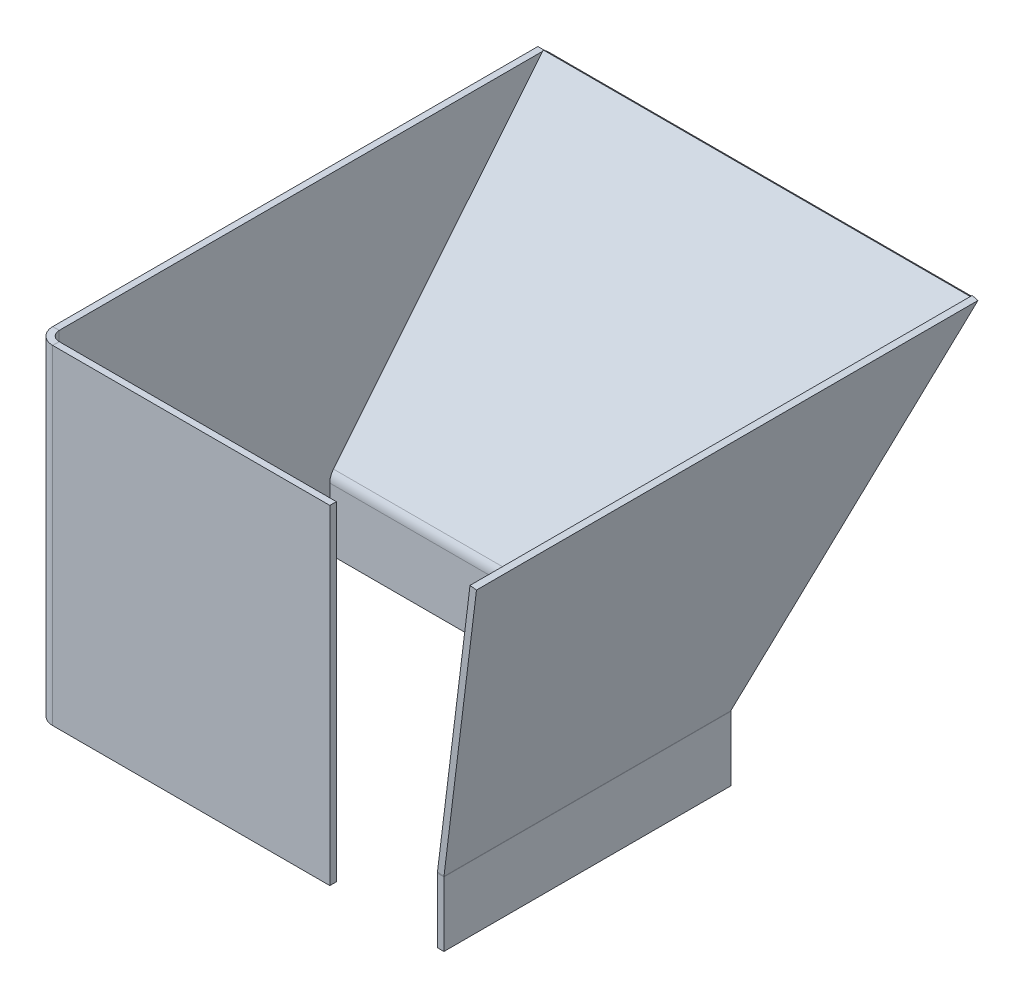
ISO-10303-21;
HEADER;
FILE_DESCRIPTION(('STEP AP214'),'2;1');
FILE_NAME('part.step','',(''),(''),'','','');
FILE_SCHEMA(('AUTOMOTIVE_DESIGN { 1 0 10303 214 1 1 1 1 }'));
ENDSEC;
DATA;
#1=APPLICATION_CONTEXT('core data for automotive mechanical design processes');
#2=APPLICATION_PROTOCOL_DEFINITION('international standard','automotive_design',2000,#1);
#3=PRODUCT_CONTEXT('',#1,'mechanical');
#4=PRODUCT('Part','Part','',(#3));
#5=PRODUCT_RELATED_PRODUCT_CATEGORY('part','',(#4));
#6=PRODUCT_DEFINITION_FORMATION('','',#4);
#7=PRODUCT_DEFINITION_CONTEXT('part definition',#1,'design');
#8=PRODUCT_DEFINITION('design','',#6,#7);
#9=PRODUCT_DEFINITION_SHAPE('','',#8);
#10=(LENGTH_UNIT() NAMED_UNIT(*) SI_UNIT(.MILLI.,.METRE.));
#11=(NAMED_UNIT(*) PLANE_ANGLE_UNIT() SI_UNIT($,.RADIAN.));
#12=(NAMED_UNIT(*) SI_UNIT($,.STERADIAN.) SOLID_ANGLE_UNIT());
#13=UNCERTAINTY_MEASURE_WITH_UNIT(LENGTH_MEASURE(1.E-05),#10,'distance_accuracy_value','');
#14=(GEOMETRIC_REPRESENTATION_CONTEXT(3) GLOBAL_UNCERTAINTY_ASSIGNED_CONTEXT((#13)) GLOBAL_UNIT_ASSIGNED_CONTEXT((#10,
#11,#12)) REPRESENTATION_CONTEXT('',''));
#15=CARTESIAN_POINT('',(0.,0.,0.));
#16=DIRECTION('',(0.,0.,1.));
#17=DIRECTION('',(1.,0.,0.));
#18=AXIS2_PLACEMENT_3D('',#15,#16,#17);
#19=CARTESIAN_POINT('',(-80.2161522217575,-14.3493079925851,30.8283420003488));
#20=DIRECTION('',(-1.,0.,0.));
#21=DIRECTION('',(0.,0.,1.));
#22=AXIS2_PLACEMENT_3D('',#19,#20,#21);
#23=PLANE('',#22);
#24=DIRECTION('',(0.,0.630592625094465,0.776114000116266));
#25=VECTOR('',#24,1.);
#26=CARTESIAN_POINT('',(-80.2161522217575,-14.3493079925851,30.8283420003488));
#27=LINE('',#26,#25);
#28=CARTESIAN_POINT('',(-80.2161522217575,-14.3493079925851,30.8283420003488));
#29=VERTEX_POINT('',#28);
#30=CARTESIAN_POINT('',(-80.2161522217575,-13.0881227423962,32.3805700005813));
#31=VERTEX_POINT('',#30);
#32=EDGE_CURVE('P0_E11',#29,#31,#27,.T.);
#33=ORIENTED_EDGE('',*,*,#32,.F.);
#34=CARTESIAN_POINT('',(-80.2161522217575,-16.2410858678685,28.5));
#35=DIRECTION('',(1.,0.,0.));
#36=DIRECTION('',(0.,0.,-1.));
#37=AXIS2_PLACEMENT_3D('',#34,#35,#36);
#38=CIRCLE('',#37,3.);
#39=CARTESIAN_POINT('',(-80.2161522217575,-16.2410858678685,31.5));
#40=VERTEX_POINT('',#39);
#41=EDGE_CURVE('P0_E133',#40,#29,#38,.F.);
#42=ORIENTED_EDGE('',*,*,#41,.F.);
#43=DIRECTION('',(0.,0.,-1.));
#44=VECTOR('',#43,1.);
#45=CARTESIAN_POINT('',(-80.2161522217575,-16.2410858678685,33.5));
#46=LINE('',#45,#44);
#47=CARTESIAN_POINT('',(-80.2161522217575,-16.2410858678685,33.5));
#48=VERTEX_POINT('',#47);
#49=EDGE_CURVE('P0_E24',#48,#40,#46,.T.);
#50=ORIENTED_EDGE('',*,*,#49,.F.);
#51=CARTESIAN_POINT('',(-80.2161522217575,-16.2410858678685,28.5));
#52=DIRECTION('',(1.,0.,0.));
#53=DIRECTION('',(0.,0.,-1.));
#54=AXIS2_PLACEMENT_3D('',#51,#52,#53);
#55=CIRCLE('',#54,5.);
#56=EDGE_CURVE('P0_E154',#48,#31,#55,.F.);
#57=ORIENTED_EDGE('',*,*,#56,.T.);
#58=EDGE_LOOP('',(#33,#42,#50,#57));
#59=FACE_BOUND('',#58,.T.);
#60=ADVANCED_FACE('P0_F17',(#59),#23,.T.);
#61=CARTESIAN_POINT('',(-80.2161522217575,-16.2410858678685,33.5));
#62=DIRECTION('',(-1.,0.,0.));
#63=DIRECTION('',(0.,0.,1.));
#64=AXIS2_PLACEMENT_3D('',#61,#62,#63);
#65=PLANE('',#64);
#66=DIRECTION('',(0.,0.776114000116265,-0.630592625094466));
#67=VECTOR('',#66,1.);
#68=CARTESIAN_POINT('',(-80.2161522217575,-15.1759639921558,31.5));
#69=LINE('',#68,#67);
#70=CARTESIAN_POINT('',(-80.2161522217575,64.8240360078442,-33.5));
#71=VERTEX_POINT('',#70);
#72=EDGE_CURVE('P0_E167',#29,#71,#69,.T.);
#73=ORIENTED_EDGE('',*,*,#72,.F.);
#74=ORIENTED_EDGE('',*,*,#32,.T.);
#75=DIRECTION('',(0.,0.776114000116266,-0.630592625094466));
#76=VECTOR('',#75,1.);
#77=CARTESIAN_POINT('',(-80.2161522217575,-13.9147787419669,33.0522280002325));
#78=LINE('',#77,#76);
#79=CARTESIAN_POINT('',(-80.2161522217575,66.0852212580331,-31.9477719997675));
#80=VERTEX_POINT('',#79);
#81=EDGE_CURVE('P0_E155',#31,#80,#78,.T.);
#82=ORIENTED_EDGE('',*,*,#81,.T.);
#83=DIRECTION('',(0.,-0.630592625094477,-0.776114000116257));
#84=VECTOR('',#83,1.);
#85=CARTESIAN_POINT('',(-80.2161522217575,66.0852212580331,-31.9477719997675));
#86=LINE('',#85,#84);
#87=EDGE_CURVE('P0_E102',#80,#71,#86,.T.);
#88=ORIENTED_EDGE('',*,*,#87,.T.);
#89=EDGE_LOOP('',(#73,#74,#82,#88));
#90=FACE_BOUND('',#89,.T.);
#91=ADVANCED_FACE('P0_F173',(#90),#65,.T.);
#92=CARTESIAN_POINT('',(50.7838477782425,-15.1759639921558,31.5));
#93=DIRECTION('',(0.,0.630592625094466,0.776114000116265));
#94=DIRECTION('',(0.,-0.776114000116266,0.630592625094466));
#95=AXIS2_PLACEMENT_3D('',#92,#93,#94);
#96=PLANE('',#95);
#97=DIRECTION('',(-1.,0.,0.));
#98=VECTOR('',#97,1.);
#99=CARTESIAN_POINT('',(50.7838477782425,64.8240360078442,-33.5));
#100=LINE('',#99,#98);
#101=CARTESIAN_POINT('',(50.630654310174,64.8240360078442,-33.5));
#102=VERTEX_POINT('',#101);
#103=EDGE_CURVE('P0_E104',#102,#71,#100,.T.);
#104=ORIENTED_EDGE('',*,*,#103,.F.);
#105=DIRECTION('',(-0.0938567556557905,-0.772688009195933,0.627809007471695));
#106=VECTOR('',#105,1.);
#107=CARTESIAN_POINT('',(41.0001770512994,-14.4601268504675,30.9183823223782));
#108=LINE('',#107,#106);
#109=CARTESIAN_POINT('',(41.0136379803452,-14.3493079925851,30.8283420003488));
#110=VERTEX_POINT('',#109);
#111=EDGE_CURVE('P0_E86',#102,#110,#108,.T.);
#112=ORIENTED_EDGE('',*,*,#111,.T.);
#113=DIRECTION('',(-1.,0.,0.));
#114=VECTOR('',#113,1.);
#115=CARTESIAN_POINT('',(50.7838477782425,-14.3493079925851,30.8283420003488));
#116=LINE('',#115,#114);
#117=EDGE_CURVE('P0_E39',#110,#29,#116,.T.);
#118=ORIENTED_EDGE('',*,*,#117,.T.);
#119=ORIENTED_EDGE('',*,*,#72,.T.);
#120=EDGE_LOOP('',(#104,#112,#118,#119));
#121=FACE_BOUND('',#120,.T.);
#122=ADVANCED_FACE('P0_F174',(#121),#96,.F.);
#123=CARTESIAN_POINT('',(50.7838477782425,66.0852212580331,-31.9477719997675));
#124=DIRECTION('',(0.,0.776114000116257,-0.630592625094476));
#125=DIRECTION('',(0.,0.630592625094477,0.776114000116257));
#126=AXIS2_PLACEMENT_3D('',#123,#124,#125);
#127=PLANE('',#126);
#128=DIRECTION('',(0.0763730191613874,0.628750863161276,0.773847216198472));
#129=VECTOR('',#128,1.);
#130=CARTESIAN_POINT('',(50.7838477782425,66.0852212580331,-31.9477719997675));
#131=LINE('',#130,#129);
#132=CARTESIAN_POINT('',(50.7838477782425,66.0852212580331,-31.9477719997675));
#133=VERTEX_POINT('',#132);
#134=EDGE_CURVE('P0_E81',#102,#133,#131,.T.);
#135=ORIENTED_EDGE('',*,*,#134,.F.);
#136=ORIENTED_EDGE('',*,*,#103,.T.);
#137=ORIENTED_EDGE('',*,*,#87,.F.);
#138=DIRECTION('',(-1.,0.,0.));
#139=VECTOR('',#138,1.);
#140=CARTESIAN_POINT('',(50.7838477782425,66.0852212580331,-31.9477719997675));
#141=LINE('',#140,#139);
#142=EDGE_CURVE('P0_E95',#133,#80,#141,.T.);
#143=ORIENTED_EDGE('',*,*,#142,.F.);
#144=EDGE_LOOP('',(#135,#136,#137,#143));
#145=FACE_BOUND('',#144,.T.);
#146=ADVANCED_FACE('P0_F100',(#145),#127,.T.);
#147=CARTESIAN_POINT('',(50.7838477782425,-13.9147787419669,33.0522280002325));
#148=DIRECTION('',(0.,0.630592625094466,0.776114000116266));
#149=DIRECTION('',(0.,-0.776114000116266,0.630592625094466));
#150=AXIS2_PLACEMENT_3D('',#147,#148,#149);
#151=PLANE('',#150);
#152=DIRECTION('',(-0.0938567556557905,-0.772688009195933,0.627809007471695));
#153=VECTOR('',#152,1.);
#154=CARTESIAN_POINT('',(41.1520210242311,-13.2100514953884,32.4796371123875));
#155=LINE('',#154,#153);
#156=CARTESIAN_POINT('',(41.1668314484137,-13.0881227423962,32.3805700005813));
#157=VERTEX_POINT('',#156);
#158=EDGE_CURVE('P0_E84',#133,#157,#155,.T.);
#159=ORIENTED_EDGE('',*,*,#158,.F.);
#160=ORIENTED_EDGE('',*,*,#142,.T.);
#161=ORIENTED_EDGE('',*,*,#81,.F.);
#162=DIRECTION('',(-1.,0.,0.));
#163=VECTOR('',#162,1.);
#164=CARTESIAN_POINT('',(50.7838477782425,-13.0881227423962,32.3805700005813));
#165=LINE('',#164,#163);
#166=EDGE_CURVE('P0_E97',#157,#31,#165,.T.);
#167=ORIENTED_EDGE('',*,*,#166,.F.);
#168=EDGE_LOOP('',(#159,#160,#161,#167));
#169=FACE_BOUND('',#168,.T.);
#170=ADVANCED_FACE('P0_F93',(#169),#151,.T.);
#171=CARTESIAN_POINT('',(50.7838477782425,-16.2410858678685,28.5));
#172=DIRECTION('',(-1.,0.,0.));
#173=DIRECTION('',(0.,0.,1.));
#174=AXIS2_PLACEMENT_3D('',#171,#172,#173);
#175=CYLINDRICAL_SURFACE('',#174,5.);
#176=CARTESIAN_POINT('',(40.7838477782425,-16.2410858678685,28.5));
#177=DIRECTION('',(-0.992703424125145,0.120581556343466,0.));
#178=DIRECTION('',(-0.120581556343466,-0.992703424125145,0.));
#179=AXIS2_PLACEMENT_3D('',#176,#177,#178);
#180=ELLIPSE('',#179,5.03675103609764,5.);
#181=CARTESIAN_POINT('',(40.7838477782425,-16.2410858678685,33.5));
#182=VERTEX_POINT('',#181);
#183=EDGE_CURVE('P0_E98',#157,#182,#180,.F.);
#184=ORIENTED_EDGE('',*,*,#183,.F.);
#185=ORIENTED_EDGE('',*,*,#166,.T.);
#186=ORIENTED_EDGE('',*,*,#56,.F.);
#187=DIRECTION('',(-1.,0.,0.));
#188=VECTOR('',#187,1.);
#189=CARTESIAN_POINT('',(50.7838477782425,-16.2410858678685,33.5));
#190=LINE('',#189,#188);
#191=EDGE_CURVE('P0_E107',#182,#48,#190,.T.);
#192=ORIENTED_EDGE('',*,*,#191,.F.);
#193=EDGE_LOOP('',(#184,#185,#186,#192));
#194=FACE_BOUND('',#193,.T.);
#195=ADVANCED_FACE('P0_F153',(#194),#175,.T.);
#196=CARTESIAN_POINT('',(50.7838477782425,-35.1759639921558,33.5));
#197=DIRECTION('',(0.,0.,1.));
#198=DIRECTION('',(1.,0.,0.));
#199=AXIS2_PLACEMENT_3D('',#196,#197,#198);
#200=PLANE('',#199);
#201=DIRECTION('',(0.,-1.,0.));
#202=VECTOR('',#201,1.);
#203=CARTESIAN_POINT('',(40.7838477782425,-35.1759639921558,33.5));
#204=LINE('',#203,#202);
#205=CARTESIAN_POINT('',(40.7838477782425,-35.1759639921558,33.5));
#206=VERTEX_POINT('',#205);
#207=EDGE_CURVE('P0_E151',#182,#206,#204,.T.);
#208=ORIENTED_EDGE('',*,*,#207,.F.);
#209=ORIENTED_EDGE('',*,*,#191,.T.);
#210=DIRECTION('',(0.,1.,0.));
#211=VECTOR('',#210,1.);
#212=CARTESIAN_POINT('',(-80.2161522217575,-35.1759639921558,33.5));
#213=LINE('',#212,#211);
#214=CARTESIAN_POINT('',(-80.2161522217575,-35.1759639921558,33.5));
#215=VERTEX_POINT('',#214);
#216=EDGE_CURVE('P0_E121',#215,#48,#213,.T.);
#217=ORIENTED_EDGE('',*,*,#216,.F.);
#218=DIRECTION('',(-1.,0.,0.));
#219=VECTOR('',#218,1.);
#220=CARTESIAN_POINT('',(50.7838477782425,-35.1759639921558,33.5));
#221=LINE('',#220,#219);
#222=EDGE_CURVE('P0_E145',#206,#215,#221,.T.);
#223=ORIENTED_EDGE('',*,*,#222,.F.);
#224=EDGE_LOOP('',(#208,#209,#217,#223));
#225=FACE_BOUND('',#224,.T.);
#226=ADVANCED_FACE('P0_F149',(#225),#200,.T.);
#227=CARTESIAN_POINT('',(50.7838477782425,-35.1759639921558,31.5));
#228=DIRECTION('',(0.,-1.,0.));
#229=DIRECTION('',(0.,0.,-1.));
#230=AXIS2_PLACEMENT_3D('',#227,#228,#229);
#231=PLANE('',#230);
#232=DIRECTION('',(0.,0.,-1.));
#233=VECTOR('',#232,1.);
#234=CARTESIAN_POINT('',(40.7838477782425,-35.1759639921558,31.5));
#235=LINE('',#234,#233);
#236=CARTESIAN_POINT('',(40.7838477782425,-35.1759639921558,31.5));
#237=VERTEX_POINT('',#236);
#238=EDGE_CURVE('P0_E163',#206,#237,#235,.T.);
#239=ORIENTED_EDGE('',*,*,#238,.F.);
#240=ORIENTED_EDGE('',*,*,#222,.T.);
#241=DIRECTION('',(0.,0.,1.));
#242=VECTOR('',#241,1.);
#243=CARTESIAN_POINT('',(-80.2161522217575,-35.1759639921558,31.5));
#244=LINE('',#243,#242);
#245=CARTESIAN_POINT('',(-80.2161522217575,-35.1759639921558,31.5));
#246=VERTEX_POINT('',#245);
#247=EDGE_CURVE('P0_E134',#246,#215,#244,.T.);
#248=ORIENTED_EDGE('',*,*,#247,.F.);
#249=DIRECTION('',(-1.,0.,0.));
#250=VECTOR('',#249,1.);
#251=CARTESIAN_POINT('',(50.7838477782425,-35.1759639921558,31.5));
#252=LINE('',#251,#250);
#253=EDGE_CURVE('P0_E132',#237,#246,#252,.T.);
#254=ORIENTED_EDGE('',*,*,#253,.F.);
#255=EDGE_LOOP('',(#239,#240,#248,#254));
#256=FACE_BOUND('',#255,.T.);
#257=ADVANCED_FACE('P0_F162',(#256),#231,.T.);
#258=CARTESIAN_POINT('',(50.7838477782425,-35.1759639921558,31.5));
#259=DIRECTION('',(0.,0.,1.));
#260=DIRECTION('',(1.,0.,0.));
#261=AXIS2_PLACEMENT_3D('',#258,#259,#260);
#262=PLANE('',#261);
#263=DIRECTION('',(-1.,0.,0.));
#264=VECTOR('',#263,1.);
#265=CARTESIAN_POINT('',(50.7838477782425,-16.2410858678685,31.5));
#266=LINE('',#265,#264);
#267=CARTESIAN_POINT('',(40.7838477782425,-16.2410858678685,31.5));
#268=VERTEX_POINT('',#267);
#269=EDGE_CURVE('P0_E130',#268,#40,#266,.T.);
#270=ORIENTED_EDGE('',*,*,#269,.F.);
#271=DIRECTION('',(0.,-1.,0.));
#272=VECTOR('',#271,1.);
#273=CARTESIAN_POINT('',(40.7838477782425,-35.1759639921558,31.5));
#274=LINE('',#273,#272);
#275=EDGE_CURVE('P0_E165',#268,#237,#274,.T.);
#276=ORIENTED_EDGE('',*,*,#275,.T.);
#277=ORIENTED_EDGE('',*,*,#253,.T.);
#278=DIRECTION('',(0.,1.,0.));
#279=VECTOR('',#278,1.);
#280=CARTESIAN_POINT('',(-80.2161522217575,-35.1759639921558,31.5));
#281=LINE('',#280,#279);
#282=EDGE_CURVE('P0_E118',#246,#40,#281,.T.);
#283=ORIENTED_EDGE('',*,*,#282,.T.);
#284=EDGE_LOOP('',(#270,#276,#277,#283));
#285=FACE_BOUND('',#284,.T.);
#286=ADVANCED_FACE('P0_F128',(#285),#262,.F.);
#287=CARTESIAN_POINT('',(50.7838477782425,-16.2410858678685,28.5));
#288=DIRECTION('',(-1.,0.,0.));
#289=DIRECTION('',(0.,0.,1.));
#290=AXIS2_PLACEMENT_3D('',#287,#288,#289);
#291=CYLINDRICAL_SURFACE('',#290,3.);
#292=ORIENTED_EDGE('',*,*,#117,.F.);
#293=CARTESIAN_POINT('',(40.7838477782425,-16.2410858678685,28.5));
#294=DIRECTION('',(-0.992703424125145,0.120581556343466,0.));
#295=DIRECTION('',(-0.120581556343466,-0.992703424125145,0.));
#296=AXIS2_PLACEMENT_3D('',#293,#294,#295);
#297=ELLIPSE('',#296,3.02205062165858,3.);
#298=EDGE_CURVE('P0_E175',#110,#268,#297,.F.);
#299=ORIENTED_EDGE('',*,*,#298,.T.);
#300=ORIENTED_EDGE('',*,*,#269,.T.);
#301=ORIENTED_EDGE('',*,*,#41,.T.);
#302=EDGE_LOOP('',(#292,#299,#300,#301));
#303=FACE_BOUND('',#302,.T.);
#304=ADVANCED_FACE('P0_F178',(#303),#291,.F.);
#305=CARTESIAN_POINT('',(-80.2161522217575,-16.2410858678685,28.5));
#306=DIRECTION('',(1.,0.,0.));
#307=DIRECTION('',(0.,0.,-1.));
#308=AXIS2_PLACEMENT_3D('',#305,#306,#307);
#309=PLANE('',#308);
#310=ORIENTED_EDGE('',*,*,#216,.T.);
#311=ORIENTED_EDGE('',*,*,#49,.T.);
#312=ORIENTED_EDGE('',*,*,#282,.F.);
#313=ORIENTED_EDGE('',*,*,#247,.T.);
#314=EDGE_LOOP('',(#310,#311,#312,#313));
#315=FACE_BOUND('',#314,.T.);
#316=ADVANCED_FACE('P0_F116',(#315),#309,.F.);
#317=CARTESIAN_POINT('',(40.7838477782425,-42.4244804173218,274.770532504408));
#318=DIRECTION('',(-1.,0.,0.));
#319=DIRECTION('',(0.,-1.,0.));
#320=AXIS2_PLACEMENT_3D('',#317,#318,#319);
#321=PLANE('',#320);
#322=DIRECTION('',(0.,0.,-1.));
#323=VECTOR('',#322,1.);
#324=CARTESIAN_POINT('',(40.7838477782425,-16.2410858678685,274.770532504408));
#325=LINE('',#324,#323);
#326=EDGE_CURVE('P0_E31',#182,#268,#325,.T.);
#327=ORIENTED_EDGE('',*,*,#326,.F.);
#328=ORIENTED_EDGE('',*,*,#207,.T.);
#329=ORIENTED_EDGE('',*,*,#238,.T.);
#330=ORIENTED_EDGE('',*,*,#275,.F.);
#331=EDGE_LOOP('',(#327,#328,#329,#330));
#332=FACE_BOUND('',#331,.T.);
#333=ADVANCED_FACE('P0_F181',(#332),#321,.F.);
#334=CARTESIAN_POINT('',(40.7838477782425,-16.2410858678685,274.770532504408));
#335=DIRECTION('',(-0.992703424125145,0.120581556343466,0.));
#336=DIRECTION('',(-0.120581556343466,-0.992703424125145,0.));
#337=AXIS2_PLACEMENT_3D('',#334,#335,#336);
#338=PLANE('',#337);
#339=ORIENTED_EDGE('',*,*,#158,.T.);
#340=ORIENTED_EDGE('',*,*,#183,.T.);
#341=ORIENTED_EDGE('',*,*,#326,.T.);
#342=ORIENTED_EDGE('',*,*,#298,.F.);
#343=ORIENTED_EDGE('',*,*,#111,.F.);
#344=ORIENTED_EDGE('',*,*,#134,.T.);
#345=EDGE_LOOP('',(#339,#340,#341,#342,#343,#344));
#346=FACE_BOUND('',#345,.T.);
#347=ADVANCED_FACE('P0_F83',(#346),#338,.F.);
#348=CLOSED_SHELL('',(#60,#91,#122,#146,#170,#195,#226,#257,#286,#304,#316,#333,#347));
#349=MANIFOLD_SOLID_BREP('P0_B1',#348);
#350=CARTESIAN_POINT('',(-480.898889708401,-15.1759639921558,33.5));
#351=DIRECTION('',(0.,-0.630592625094467,-0.776114000116265));
#352=DIRECTION('',(0.,0.776114000116265,-0.630592625094467));
#353=AXIS2_PLACEMENT_3D('',#350,#351,#352);
#354=PLANE('',#353);
#355=DIRECTION('',(-0.987661664020755,0.121541626667146,-0.098752571667056));
#356=VECTOR('',#355,1.);
#357=CARTESIAN_POINT('',(65.8065140466059,64.2365322163815,-31.0226531694368));
#358=LINE('',#357,#356);
#359=CARTESIAN_POINT('',(52.7688738769059,65.8409439819201,-32.3262377289368));
#360=VERTEX_POINT('',#359);
#361=CARTESIAN_POINT('',(50.7838477782425,66.0852212580331,-32.5247130157787));
#362=VERTEX_POINT('',#361);
#363=EDGE_CURVE('P1_E153',#360,#362,#358,.T.);
#364=ORIENTED_EDGE('',*,*,#363,.F.);
#365=DIRECTION('',(-0.0950759233927072,-0.772598222364756,0.627736055671365));
#366=VECTOR('',#365,1.);
#367=CARTESIAN_POINT('',(37.5422619986757,-57.8923088750386,68.2070302173423));
#368=LINE('',#367,#366);
#369=CARTESIAN_POINT('',(42.7989346341248,-15.1759639921558,33.5));
#370=VERTEX_POINT('',#369);
#371=EDGE_CURVE('P1_E36',#360,#370,#368,.T.);
#372=ORIENTED_EDGE('',*,*,#371,.T.);
#373=DIRECTION('',(1.,0.,0.));
#374=VECTOR('',#373,1.);
#375=CARTESIAN_POINT('',(-480.898889708401,-15.1759639921558,33.5));
#376=LINE('',#375,#374);
#377=CARTESIAN_POINT('',(40.7894893952805,-15.1759639921558,33.5));
#378=VERTEX_POINT('',#377);
#379=EDGE_CURVE('P1_E163',#378,#370,#376,.T.);
#380=ORIENTED_EDGE('',*,*,#379,.F.);
#381=CARTESIAN_POINT('',(43.7838477782425,-15.3598603607605,33.6494157994913));
#382=DIRECTION('',(0.,-0.630592625094467,-0.776114000116265));
#383=DIRECTION('',(0.,0.776114000116265,-0.630592625094467));
#384=AXIS2_PLACEMENT_3D('',#381,#382,#383);
#385=ELLIPSE('',#384,3.86541152401656,3.);
#386=CARTESIAN_POINT('',(40.8063086302474,-14.9934444465909,33.3517028692285));
#387=VERTEX_POINT('',#386);
#388=EDGE_CURVE('P1_E11',#387,#378,#385,.F.);
#389=ORIENTED_EDGE('',*,*,#388,.F.);
#390=DIRECTION('',(-0.0950759233927072,-0.772598222364756,0.627736055671365));
#391=VECTOR('',#390,1.);
#392=CARTESIAN_POINT('',(35.5453903818072,-57.7442896838504,68.0867646245019));
#393=LINE('',#392,#391);
#394=EDGE_CURVE('P1_E155',#362,#387,#393,.T.);
#395=ORIENTED_EDGE('',*,*,#394,.F.);
#396=EDGE_LOOP('',(#364,#372,#380,#389,#395));
#397=FACE_BOUND('',#396,.T.);
#398=ADVANCED_FACE('P1_F17',(#397),#354,.T.);
#399=CARTESIAN_POINT('',(-480.898889708401,-35.1759639921558,33.5));
#400=DIRECTION('',(0.,0.,-1.));
#401=DIRECTION('',(-1.,0.,0.));
#402=AXIS2_PLACEMENT_3D('',#399,#400,#401);
#403=PLANE('',#402);
#404=CARTESIAN_POINT('',(43.7838477782425,-15.3598603607605,33.5));
#405=DIRECTION('',(0.,0.,-1.));
#406=DIRECTION('',(-1.,0.,0.));
#407=AXIS2_PLACEMENT_3D('',#404,#405,#406);
#408=CIRCLE('',#407,3.);
#409=CARTESIAN_POINT('',(40.7838477782425,-15.3598603607605,33.5));
#410=VERTEX_POINT('',#409);
#411=EDGE_CURVE('P1_E157',#378,#410,#408,.F.);
#412=ORIENTED_EDGE('',*,*,#411,.F.);
#413=ORIENTED_EDGE('',*,*,#379,.T.);
#414=DIRECTION('',(-0.122138638056524,-0.992513049331694,0.));
#415=VECTOR('',#414,1.);
#416=CARTESIAN_POINT('',(42.7913347289108,-15.237721722704,33.5));
#417=LINE('',#416,#415);
#418=CARTESIAN_POINT('',(42.7913347289108,-15.237721722704,33.5));
#419=VERTEX_POINT('',#418);
#420=EDGE_CURVE('P1_E32',#370,#419,#417,.T.);
#421=ORIENTED_EDGE('',*,*,#420,.T.);
#422=CARTESIAN_POINT('',(43.7838477782425,-15.3598603607605,33.5));
#423=DIRECTION('',(0.,0.,-1.));
#424=DIRECTION('',(-1.,0.,0.));
#425=AXIS2_PLACEMENT_3D('',#422,#423,#424);
#426=CIRCLE('',#425,1.);
#427=CARTESIAN_POINT('',(42.7838477782425,-15.3598603607605,33.5));
#428=VERTEX_POINT('',#427);
#429=EDGE_CURVE('P1_E25',#419,#428,#426,.F.);
#430=ORIENTED_EDGE('',*,*,#429,.T.);
#431=DIRECTION('',(0.,-1.,0.));
#432=VECTOR('',#431,1.);
#433=CARTESIAN_POINT('',(42.7838477782425,-35.1759639921558,33.5));
#434=LINE('',#433,#432);
#435=CARTESIAN_POINT('',(42.7838477782425,-35.1759639921558,33.5));
#436=VERTEX_POINT('',#435);
#437=EDGE_CURVE('P1_E101',#428,#436,#434,.T.);
#438=ORIENTED_EDGE('',*,*,#437,.T.);
#439=DIRECTION('',(1.,0.,0.));
#440=VECTOR('',#439,1.);
#441=CARTESIAN_POINT('',(-480.898889708401,-35.1759639921558,33.5));
#442=LINE('',#441,#440);
#443=CARTESIAN_POINT('',(40.7838477782425,-35.1759639921558,33.5));
#444=VERTEX_POINT('',#443);
#445=EDGE_CURVE('P1_E105',#444,#436,#442,.T.);
#446=ORIENTED_EDGE('',*,*,#445,.F.);
#447=DIRECTION('',(0.,-1.,0.));
#448=VECTOR('',#447,1.);
#449=CARTESIAN_POINT('',(40.7838477782425,-35.1759639921558,33.5));
#450=LINE('',#449,#448);
#451=EDGE_CURVE('P1_E159',#410,#444,#450,.T.);
#452=ORIENTED_EDGE('',*,*,#451,.F.);
#453=EDGE_LOOP('',(#412,#413,#421,#430,#438,#446,#452));
#454=FACE_BOUND('',#453,.T.);
#455=ADVANCED_FACE('P1_F108',(#454),#403,.T.);
#456=CARTESIAN_POINT('',(42.7913347289108,-15.237721722704,121.5));
#457=DIRECTION('',(-0.992513049331694,0.122138638056524,0.));
#458=DIRECTION('',(-0.122138638056524,-0.992513049331694,0.));
#459=AXIS2_PLACEMENT_3D('',#456,#457,#458);
#460=PLANE('',#459);
#461=ORIENTED_EDGE('',*,*,#420,.F.);
#462=ORIENTED_EDGE('',*,*,#371,.F.);
#463=DIRECTION('',(0.,0.,-1.));
#464=VECTOR('',#463,1.);
#465=CARTESIAN_POINT('',(52.7688738769059,65.8409439819201,121.5));
#466=LINE('',#465,#464);
#467=CARTESIAN_POINT('',(52.7688738769059,65.8409439819201,121.5));
#468=VERTEX_POINT('',#467);
#469=EDGE_CURVE('P1_E115',#468,#360,#466,.T.);
#470=ORIENTED_EDGE('',*,*,#469,.F.);
#471=DIRECTION('',(0.122138638056523,0.992513049331694,0.));
#472=VECTOR('',#471,1.);
#473=CARTESIAN_POINT('',(42.7913347289108,-15.237721722704,121.5));
#474=LINE('',#473,#472);
#475=CARTESIAN_POINT('',(42.7913347289108,-15.237721722704,121.5));
#476=VERTEX_POINT('',#475);
#477=EDGE_CURVE('P1_E150',#476,#468,#474,.T.);
#478=ORIENTED_EDGE('',*,*,#477,.F.);
#479=DIRECTION('',(0.,0.,-1.));
#480=VECTOR('',#479,1.);
#481=CARTESIAN_POINT('',(42.7913347289108,-15.237721722704,121.5));
#482=LINE('',#481,#480);
#483=EDGE_CURVE('P1_E97',#476,#419,#482,.T.);
#484=ORIENTED_EDGE('',*,*,#483,.T.);
#485=EDGE_LOOP('',(#461,#462,#470,#478,#484));
#486=FACE_BOUND('',#485,.T.);
#487=ADVANCED_FACE('P1_F206',(#486),#460,.F.);
#488=CARTESIAN_POINT('',(50.7838477782425,66.0852212580331,121.5));
#489=DIRECTION('',(0.122138638056532,0.992513049331693,0.));
#490=DIRECTION('',(-0.992513049331693,0.122138638056532,0.));
#491=AXIS2_PLACEMENT_3D('',#488,#489,#490);
#492=PLANE('',#491);
#493=ORIENTED_EDGE('',*,*,#469,.T.);
#494=ORIENTED_EDGE('',*,*,#363,.T.);
#495=DIRECTION('',(0.,0.,-1.));
#496=VECTOR('',#495,1.);
#497=CARTESIAN_POINT('',(50.7838477782425,66.0852212580331,121.5));
#498=LINE('',#497,#496);
#499=CARTESIAN_POINT('',(50.7838477782425,66.0852212580331,121.5));
#500=VERTEX_POINT('',#499);
#501=EDGE_CURVE('P1_E117',#500,#362,#498,.T.);
#502=ORIENTED_EDGE('',*,*,#501,.F.);
#503=DIRECTION('',(0.992513049331693,-0.122138638056532,0.));
#504=VECTOR('',#503,1.);
#505=CARTESIAN_POINT('',(50.7838477782425,66.0852212580331,121.5));
#506=LINE('',#505,#504);
#507=EDGE_CURVE('P1_E147',#500,#468,#506,.T.);
#508=ORIENTED_EDGE('',*,*,#507,.T.);
#509=EDGE_LOOP('',(#493,#494,#502,#508));
#510=FACE_BOUND('',#509,.T.);
#511=ADVANCED_FACE('P1_F171',(#510),#492,.T.);
#512=CARTESIAN_POINT('',(40.8063086302474,-14.9934444465909,121.5));
#513=DIRECTION('',(-0.992513049331694,0.122138638056524,0.));
#514=DIRECTION('',(-0.122138638056524,-0.992513049331694,0.));
#515=AXIS2_PLACEMENT_3D('',#512,#513,#514);
#516=PLANE('',#515);
#517=ORIENTED_EDGE('',*,*,#501,.T.);
#518=ORIENTED_EDGE('',*,*,#394,.T.);
#519=DIRECTION('',(0.,0.,-1.));
#520=VECTOR('',#519,1.);
#521=CARTESIAN_POINT('',(40.8063086302474,-14.9934444465909,121.5));
#522=LINE('',#521,#520);
#523=CARTESIAN_POINT('',(40.8063086302474,-14.9934444465909,121.5));
#524=VERTEX_POINT('',#523);
#525=EDGE_CURVE('P1_E120',#524,#387,#522,.T.);
#526=ORIENTED_EDGE('',*,*,#525,.F.);
#527=DIRECTION('',(0.122138638056524,0.992513049331694,0.));
#528=VECTOR('',#527,1.);
#529=CARTESIAN_POINT('',(40.8063086302474,-14.9934444465909,121.5));
#530=LINE('',#529,#528);
#531=EDGE_CURVE('P1_E144',#524,#500,#530,.T.);
#532=ORIENTED_EDGE('',*,*,#531,.T.);
#533=EDGE_LOOP('',(#517,#518,#526,#532));
#534=FACE_BOUND('',#533,.T.);
#535=ADVANCED_FACE('P1_F174',(#534),#516,.T.);
#536=CARTESIAN_POINT('',(43.7838477782425,-15.3598603607605,121.5));
#537=DIRECTION('',(0.,0.,-1.));
#538=DIRECTION('',(-1.,0.,0.));
#539=AXIS2_PLACEMENT_3D('',#536,#537,#538);
#540=CYLINDRICAL_SURFACE('',#539,3.);
#541=ORIENTED_EDGE('',*,*,#388,.T.);
#542=ORIENTED_EDGE('',*,*,#411,.T.);
#543=DIRECTION('',(0.,0.,-1.));
#544=VECTOR('',#543,1.);
#545=CARTESIAN_POINT('',(40.7838477782425,-15.3598603607605,121.5));
#546=LINE('',#545,#544);
#547=CARTESIAN_POINT('',(40.7838477782425,-15.3598603607605,121.5));
#548=VERTEX_POINT('',#547);
#549=EDGE_CURVE('P1_E123',#548,#410,#546,.T.);
#550=ORIENTED_EDGE('',*,*,#549,.F.);
#551=CARTESIAN_POINT('',(43.7838477782425,-15.3598603607605,121.5));
#552=DIRECTION('',(0.,0.,-1.));
#553=DIRECTION('',(-1.,0.,0.));
#554=AXIS2_PLACEMENT_3D('',#551,#552,#553);
#555=CIRCLE('',#554,3.);
#556=EDGE_CURVE('P1_E141',#548,#524,#555,.T.);
#557=ORIENTED_EDGE('',*,*,#556,.T.);
#558=ORIENTED_EDGE('',*,*,#525,.T.);
#559=EDGE_LOOP('',(#541,#542,#550,#557,#558));
#560=FACE_BOUND('',#559,.T.);
#561=ADVANCED_FACE('P1_F182',(#560),#540,.T.);
#562=CARTESIAN_POINT('',(40.7838477782425,-35.1759639921558,121.5));
#563=DIRECTION('',(-1.,0.,0.));
#564=DIRECTION('',(0.,0.,1.));
#565=AXIS2_PLACEMENT_3D('',#562,#563,#564);
#566=PLANE('',#565);
#567=ORIENTED_EDGE('',*,*,#549,.T.);
#568=ORIENTED_EDGE('',*,*,#451,.T.);
#569=DIRECTION('',(0.,0.,-1.));
#570=VECTOR('',#569,1.);
#571=CARTESIAN_POINT('',(40.7838477782425,-35.1759639921558,121.5));
#572=LINE('',#571,#570);
#573=CARTESIAN_POINT('',(40.7838477782425,-35.1759639921558,121.5));
#574=VERTEX_POINT('',#573);
#575=EDGE_CURVE('P1_E126',#574,#444,#572,.T.);
#576=ORIENTED_EDGE('',*,*,#575,.F.);
#577=DIRECTION('',(0.,1.,0.));
#578=VECTOR('',#577,1.);
#579=CARTESIAN_POINT('',(40.7838477782425,-35.1759639921558,121.5));
#580=LINE('',#579,#578);
#581=EDGE_CURVE('P1_E138',#574,#548,#580,.T.);
#582=ORIENTED_EDGE('',*,*,#581,.T.);
#583=EDGE_LOOP('',(#567,#568,#576,#582));
#584=FACE_BOUND('',#583,.T.);
#585=ADVANCED_FACE('P1_F186',(#584),#566,.T.);
#586=CARTESIAN_POINT('',(42.7838477782425,-35.1759639921558,121.5));
#587=DIRECTION('',(0.,-1.,0.));
#588=DIRECTION('',(0.,0.,-1.));
#589=AXIS2_PLACEMENT_3D('',#586,#587,#588);
#590=PLANE('',#589);
#591=ORIENTED_EDGE('',*,*,#575,.T.);
#592=ORIENTED_EDGE('',*,*,#445,.T.);
#593=DIRECTION('',(0.,0.,-1.));
#594=VECTOR('',#593,1.);
#595=CARTESIAN_POINT('',(42.7838477782425,-35.1759639921558,121.5));
#596=LINE('',#595,#594);
#597=CARTESIAN_POINT('',(42.7838477782425,-35.1759639921558,121.5));
#598=VERTEX_POINT('',#597);
#599=EDGE_CURVE('P1_E96',#598,#436,#596,.T.);
#600=ORIENTED_EDGE('',*,*,#599,.F.);
#601=DIRECTION('',(-1.,0.,0.));
#602=VECTOR('',#601,1.);
#603=CARTESIAN_POINT('',(42.7838477782425,-35.1759639921558,121.5));
#604=LINE('',#603,#602);
#605=EDGE_CURVE('P1_E135',#598,#574,#604,.T.);
#606=ORIENTED_EDGE('',*,*,#605,.T.);
#607=EDGE_LOOP('',(#591,#592,#600,#606));
#608=FACE_BOUND('',#607,.T.);
#609=ADVANCED_FACE('P1_F191',(#608),#590,.T.);
#610=CARTESIAN_POINT('',(42.7838477782425,-35.1759639921558,121.5));
#611=DIRECTION('',(-1.,0.,0.));
#612=DIRECTION('',(0.,0.,1.));
#613=AXIS2_PLACEMENT_3D('',#610,#611,#612);
#614=PLANE('',#613);
#615=ORIENTED_EDGE('',*,*,#437,.F.);
#616=DIRECTION('',(0.,0.,-1.));
#617=VECTOR('',#616,1.);
#618=CARTESIAN_POINT('',(42.7838477782425,-15.3598603607605,121.5));
#619=LINE('',#618,#617);
#620=CARTESIAN_POINT('',(42.7838477782425,-15.3598603607605,121.5));
#621=VERTEX_POINT('',#620);
#622=EDGE_CURVE('P1_E87',#621,#428,#619,.T.);
#623=ORIENTED_EDGE('',*,*,#622,.F.);
#624=DIRECTION('',(0.,1.,0.));
#625=VECTOR('',#624,1.);
#626=CARTESIAN_POINT('',(42.7838477782425,-35.1759639921558,121.5));
#627=LINE('',#626,#625);
#628=EDGE_CURVE('P1_E132',#598,#621,#627,.T.);
#629=ORIENTED_EDGE('',*,*,#628,.F.);
#630=ORIENTED_EDGE('',*,*,#599,.T.);
#631=EDGE_LOOP('',(#615,#623,#629,#630));
#632=FACE_BOUND('',#631,.T.);
#633=ADVANCED_FACE('P1_F102',(#632),#614,.F.);
#634=CARTESIAN_POINT('',(43.7838477782425,-15.3598603607605,121.5));
#635=DIRECTION('',(0.,0.,-1.));
#636=DIRECTION('',(-1.,0.,0.));
#637=AXIS2_PLACEMENT_3D('',#634,#635,#636);
#638=CYLINDRICAL_SURFACE('',#637,1.);
#639=ORIENTED_EDGE('',*,*,#429,.F.);
#640=ORIENTED_EDGE('',*,*,#483,.F.);
#641=CARTESIAN_POINT('',(43.7838477782425,-15.3598603607605,121.5));
#642=DIRECTION('',(0.,0.,1.));
#643=DIRECTION('',(1.,0.,0.));
#644=AXIS2_PLACEMENT_3D('',#641,#642,#643);
#645=CIRCLE('',#644,1.);
#646=EDGE_CURVE('P1_E93',#621,#476,#645,.F.);
#647=ORIENTED_EDGE('',*,*,#646,.F.);
#648=ORIENTED_EDGE('',*,*,#622,.T.);
#649=EDGE_LOOP('',(#639,#640,#647,#648));
#650=FACE_BOUND('',#649,.T.);
#651=ADVANCED_FACE('P1_F89',(#650),#638,.F.);
#652=CARTESIAN_POINT('',(40.8063086302474,-14.9934444465909,121.5));
#653=DIRECTION('',(0.,0.,1.));
#654=DIRECTION('',(1.,0.,0.));
#655=AXIS2_PLACEMENT_3D('',#652,#653,#654);
#656=PLANE('',#655);
#657=DIRECTION('',(0.992513049331694,-0.122138638056523,0.));
#658=VECTOR('',#657,1.);
#659=CARTESIAN_POINT('',(40.8063086302474,-14.9934444465909,121.5));
#660=LINE('',#659,#658);
#661=EDGE_CURVE('P1_E110',#524,#476,#660,.T.);
#662=ORIENTED_EDGE('',*,*,#661,.F.);
#663=ORIENTED_EDGE('',*,*,#556,.F.);
#664=DIRECTION('',(-1.,0.,0.));
#665=VECTOR('',#664,1.);
#666=CARTESIAN_POINT('',(42.7838477782425,-15.3598603607605,121.5));
#667=LINE('',#666,#665);
#668=EDGE_CURVE('P1_E111',#621,#548,#667,.T.);
#669=ORIENTED_EDGE('',*,*,#668,.F.);
#670=ORIENTED_EDGE('',*,*,#646,.T.);
#671=EDGE_LOOP('',(#662,#663,#669,#670));
#672=FACE_BOUND('',#671,.T.);
#673=ADVANCED_FACE('P1_F19',(#672),#656,.T.);
#674=CARTESIAN_POINT('',(42.7838477782425,-15.3598603607605,121.5));
#675=DIRECTION('',(0.,0.,1.));
#676=DIRECTION('',(1.,0.,0.));
#677=AXIS2_PLACEMENT_3D('',#674,#675,#676);
#678=PLANE('',#677);
#679=ORIENTED_EDGE('',*,*,#531,.F.);
#680=ORIENTED_EDGE('',*,*,#661,.T.);
#681=ORIENTED_EDGE('',*,*,#477,.T.);
#682=ORIENTED_EDGE('',*,*,#507,.F.);
#683=EDGE_LOOP('',(#679,#680,#681,#682));
#684=FACE_BOUND('',#683,.T.);
#685=ADVANCED_FACE('P1_F178',(#684),#678,.T.);
#686=CARTESIAN_POINT('',(43.7838477782425,-15.3598603607605,121.5));
#687=DIRECTION('',(0.,0.,-1.));
#688=DIRECTION('',(-1.,0.,0.));
#689=AXIS2_PLACEMENT_3D('',#686,#687,#688);
#690=PLANE('',#689);
#691=ORIENTED_EDGE('',*,*,#628,.T.);
#692=ORIENTED_EDGE('',*,*,#668,.T.);
#693=ORIENTED_EDGE('',*,*,#581,.F.);
#694=ORIENTED_EDGE('',*,*,#605,.F.);
#695=EDGE_LOOP('',(#691,#692,#693,#694));
#696=FACE_BOUND('',#695,.T.);
#697=ADVANCED_FACE('P1_F189',(#696),#690,.F.);
#698=CLOSED_SHELL('',(#398,#455,#487,#511,#535,#561,#585,#609,#633,#651,#673,#685,#697));
#699=MANIFOLD_SOLID_BREP('P1_B1',#698);
#700=CARTESIAN_POINT('',(-82.2161522217575,65.8240360078442,116.5));
#701=DIRECTION('',(0.,1.,0.));
#702=DIRECTION('',(-1.,0.,0.));
#703=AXIS2_PLACEMENT_3D('',#700,#701,#702);
#704=PLANE('',#703);
#705=DIRECTION('',(1.,0.,0.));
#706=VECTOR('',#705,1.);
#707=CARTESIAN_POINT('',(-82.2161522217575,65.8240360078442,116.5));
#708=LINE('',#707,#706);
#709=CARTESIAN_POINT('',(-82.2161522217575,65.8240360078442,116.5));
#710=VERTEX_POINT('',#709);
#711=CARTESIAN_POINT('',(-80.2161522217575,65.8240360078442,116.5));
#712=VERTEX_POINT('',#711);
#713=EDGE_CURVE('P2_E101',#710,#712,#708,.T.);
#714=ORIENTED_EDGE('',*,*,#713,.F.);
#715=CARTESIAN_POINT('',(-77.2161522217575,65.8240360078442,116.5));
#716=DIRECTION('',(0.,-1.,0.));
#717=DIRECTION('',(1.,0.,0.));
#718=AXIS2_PLACEMENT_3D('',#715,#716,#717);
#719=CIRCLE('',#718,5.);
#720=CARTESIAN_POINT('',(-77.2161522217575,65.8240360078442,121.5));
#721=VERTEX_POINT('',#720);
#722=EDGE_CURVE('P2_E125',#710,#721,#719,.F.);
#723=ORIENTED_EDGE('',*,*,#722,.T.);
#724=DIRECTION('',(0.,0.,1.));
#725=VECTOR('',#724,1.);
#726=CARTESIAN_POINT('',(-77.2161522217575,65.8240360078442,119.5));
#727=LINE('',#726,#725);
#728=CARTESIAN_POINT('',(-77.2161522217575,65.8240360078442,119.5));
#729=VERTEX_POINT('',#728);
#730=EDGE_CURVE('P2_E39',#729,#721,#727,.T.);
#731=ORIENTED_EDGE('',*,*,#730,.F.);
#732=CARTESIAN_POINT('',(-77.2161522217575,65.8240360078442,116.5));
#733=DIRECTION('',(0.,1.,0.));
#734=DIRECTION('',(0.,0.,1.));
#735=AXIS2_PLACEMENT_3D('',#732,#733,#734);
#736=CIRCLE('',#735,3.);
#737=EDGE_CURVE('P2_E98',#712,#729,#736,.T.);
#738=ORIENTED_EDGE('',*,*,#737,.F.);
#739=EDGE_LOOP('',(#714,#723,#731,#738));
#740=FACE_BOUND('',#739,.T.);
#741=ADVANCED_FACE('P2_F16',(#740),#704,.T.);
#742=CARTESIAN_POINT('',(-77.2161522217575,65.8240360078442,119.5));
#743=DIRECTION('',(0.,1.,0.));
#744=DIRECTION('',(-1.,0.,0.));
#745=AXIS2_PLACEMENT_3D('',#742,#743,#744);
#746=PLANE('',#745);
#747=DIRECTION('',(1.,0.,0.));
#748=VECTOR('',#747,1.);
#749=CARTESIAN_POINT('',(-77.2161522217575,65.8240360078442,-32.3125));
#750=LINE('',#749,#748);
#751=CARTESIAN_POINT('',(-82.2161522217575,65.8240360078442,-32.3125));
#752=VERTEX_POINT('',#751);
#753=CARTESIAN_POINT('',(-80.2161522217575,65.8240360078442,-32.3125));
#754=VERTEX_POINT('',#753);
#755=EDGE_CURVE('P2_E167',#752,#754,#750,.T.);
#756=ORIENTED_EDGE('',*,*,#755,.F.);
#757=DIRECTION('',(0.,0.,1.));
#758=VECTOR('',#757,1.);
#759=CARTESIAN_POINT('',(-82.2161522217575,65.8240360078442,-58.5));
#760=LINE('',#759,#758);
#761=EDGE_CURVE('P2_E97',#752,#710,#760,.T.);
#762=ORIENTED_EDGE('',*,*,#761,.T.);
#763=ORIENTED_EDGE('',*,*,#713,.T.);
#764=DIRECTION('',(0.,0.,1.));
#765=VECTOR('',#764,1.);
#766=CARTESIAN_POINT('',(-80.2161522217575,65.8240360078442,-58.5));
#767=LINE('',#766,#765);
#768=EDGE_CURVE('P2_E86',#754,#712,#767,.T.);
#769=ORIENTED_EDGE('',*,*,#768,.F.);
#770=EDGE_LOOP('',(#756,#762,#763,#769));
#771=FACE_BOUND('',#770,.T.);
#772=ADVANCED_FACE('P2_F102',(#771),#746,.T.);
#773=CARTESIAN_POINT('',(-77.2161522217575,-35.1759639921558,121.5));
#774=DIRECTION('',(0.,-1.,0.));
#775=DIRECTION('',(1.,0.,0.));
#776=AXIS2_PLACEMENT_3D('',#773,#774,#775);
#777=PLANE('',#776);
#778=DIRECTION('',(0.,0.,-1.));
#779=VECTOR('',#778,1.);
#780=CARTESIAN_POINT('',(-77.2161522217575,-35.1759639921558,121.5));
#781=LINE('',#780,#779);
#782=CARTESIAN_POINT('',(-77.2161522217575,-35.1759639921558,121.5));
#783=VERTEX_POINT('',#782);
#784=CARTESIAN_POINT('',(-77.2161522217575,-35.1759639921558,119.5));
#785=VERTEX_POINT('',#784);
#786=EDGE_CURVE('P2_E67',#783,#785,#781,.T.);
#787=ORIENTED_EDGE('',*,*,#786,.F.);
#788=CARTESIAN_POINT('',(-77.2161522217575,-35.1759639921558,116.5));
#789=DIRECTION('',(0.,-1.,0.));
#790=DIRECTION('',(1.,0.,0.));
#791=AXIS2_PLACEMENT_3D('',#788,#789,#790);
#792=CIRCLE('',#791,5.);
#793=CARTESIAN_POINT('',(-82.2161522217575,-35.1759639921558,116.5));
#794=VERTEX_POINT('',#793);
#795=EDGE_CURVE('P2_E142',#794,#783,#792,.F.);
#796=ORIENTED_EDGE('',*,*,#795,.F.);
#797=DIRECTION('',(-1.,0.,0.));
#798=VECTOR('',#797,1.);
#799=CARTESIAN_POINT('',(-80.2161522217575,-35.1759639921558,116.5));
#800=LINE('',#799,#798);
#801=CARTESIAN_POINT('',(-80.2161522217575,-35.1759639921558,116.5));
#802=VERTEX_POINT('',#801);
#803=EDGE_CURVE('P2_E153',#802,#794,#800,.T.);
#804=ORIENTED_EDGE('',*,*,#803,.F.);
#805=CARTESIAN_POINT('',(-77.2161522217575,-35.1759639921558,116.5));
#806=DIRECTION('',(0.,1.,0.));
#807=DIRECTION('',(0.,0.,1.));
#808=AXIS2_PLACEMENT_3D('',#805,#806,#807);
#809=CIRCLE('',#808,3.);
#810=EDGE_CURVE('P2_E112',#802,#785,#809,.T.);
#811=ORIENTED_EDGE('',*,*,#810,.T.);
#812=EDGE_LOOP('',(#787,#796,#804,#811));
#813=FACE_BOUND('',#812,.T.);
#814=ADVANCED_FACE('P2_F186',(#813),#777,.T.);
#815=CARTESIAN_POINT('',(-80.2161522217575,-35.1759639921558,116.5));
#816=DIRECTION('',(0.,-1.,0.));
#817=DIRECTION('',(1.,0.,0.));
#818=AXIS2_PLACEMENT_3D('',#815,#816,#817);
#819=PLANE('',#818);
#820=DIRECTION('',(1.,0.,0.));
#821=VECTOR('',#820,1.);
#822=CARTESIAN_POINT('',(-82.2161522217575,-35.1759639921558,121.5));
#823=LINE('',#822,#821);
#824=CARTESIAN_POINT('',(7.78384777824245,-35.1759639921558,121.5));
#825=VERTEX_POINT('',#824);
#826=EDGE_CURVE('P2_E128',#783,#825,#823,.T.);
#827=ORIENTED_EDGE('',*,*,#826,.F.);
#828=ORIENTED_EDGE('',*,*,#786,.T.);
#829=DIRECTION('',(1.,0.,0.));
#830=VECTOR('',#829,1.);
#831=CARTESIAN_POINT('',(-82.2161522217575,-35.1759639921558,119.5));
#832=LINE('',#831,#830);
#833=CARTESIAN_POINT('',(7.78384777824245,-35.1759639921558,119.5));
#834=VERTEX_POINT('',#833);
#835=EDGE_CURVE('P2_E134',#785,#834,#832,.T.);
#836=ORIENTED_EDGE('',*,*,#835,.T.);
#837=DIRECTION('',(0.,0.,1.));
#838=VECTOR('',#837,1.);
#839=CARTESIAN_POINT('',(7.78384777824245,-35.1759639921558,119.5));
#840=LINE('',#839,#838);
#841=EDGE_CURVE('P2_E131',#834,#825,#840,.T.);
#842=ORIENTED_EDGE('',*,*,#841,.T.);
#843=EDGE_LOOP('',(#827,#828,#836,#842));
#844=FACE_BOUND('',#843,.T.);
#845=ADVANCED_FACE('P2_F215',(#844),#819,.T.);
#846=CARTESIAN_POINT('',(-82.2161522217575,65.8240360078442,121.5));
#847=DIRECTION('',(0.,0.,-1.));
#848=DIRECTION('',(-1.,0.,0.));
#849=AXIS2_PLACEMENT_3D('',#846,#847,#848);
#850=PLANE('',#849);
#851=ORIENTED_EDGE('',*,*,#826,.T.);
#852=DIRECTION('',(0.,-1.,0.));
#853=VECTOR('',#852,1.);
#854=CARTESIAN_POINT('',(7.78384777824245,65.8240360078442,121.5));
#855=LINE('',#854,#853);
#856=CARTESIAN_POINT('',(7.78384777824245,65.8240360078442,121.5));
#857=VERTEX_POINT('',#856);
#858=EDGE_CURVE('P2_E151',#857,#825,#855,.T.);
#859=ORIENTED_EDGE('',*,*,#858,.F.);
#860=DIRECTION('',(1.,0.,0.));
#861=VECTOR('',#860,1.);
#862=CARTESIAN_POINT('',(-82.2161522217575,65.8240360078442,121.5));
#863=LINE('',#862,#861);
#864=EDGE_CURVE('P2_E73',#721,#857,#863,.T.);
#865=ORIENTED_EDGE('',*,*,#864,.F.);
#866=DIRECTION('',(0.,-1.,0.));
#867=VECTOR('',#866,1.);
#868=CARTESIAN_POINT('',(-77.2161522217575,65.8240360078442,121.5));
#869=LINE('',#868,#867);
#870=EDGE_CURVE('P2_E127',#721,#783,#869,.T.);
#871=ORIENTED_EDGE('',*,*,#870,.T.);
#872=EDGE_LOOP('',(#851,#859,#865,#871));
#873=FACE_BOUND('',#872,.T.);
#874=ADVANCED_FACE('P2_F220',(#873),#850,.F.);
#875=CARTESIAN_POINT('',(7.78384777824245,65.8240360078442,119.5));
#876=DIRECTION('',(1.,0.,0.));
#877=DIRECTION('',(0.,0.,-1.));
#878=AXIS2_PLACEMENT_3D('',#875,#876,#877);
#879=PLANE('',#878);
#880=ORIENTED_EDGE('',*,*,#841,.F.);
#881=DIRECTION('',(0.,-1.,0.));
#882=VECTOR('',#881,1.);
#883=CARTESIAN_POINT('',(7.78384777824245,65.8240360078442,119.5));
#884=LINE('',#883,#882);
#885=CARTESIAN_POINT('',(7.78384777824245,65.8240360078442,119.5));
#886=VERTEX_POINT('',#885);
#887=EDGE_CURVE('P2_E149',#886,#834,#884,.T.);
#888=ORIENTED_EDGE('',*,*,#887,.F.);
#889=DIRECTION('',(0.,0.,1.));
#890=VECTOR('',#889,1.);
#891=CARTESIAN_POINT('',(7.78384777824245,65.8240360078442,119.5));
#892=LINE('',#891,#890);
#893=EDGE_CURVE('P2_E120',#886,#857,#892,.T.);
#894=ORIENTED_EDGE('',*,*,#893,.T.);
#895=ORIENTED_EDGE('',*,*,#858,.T.);
#896=EDGE_LOOP('',(#880,#888,#894,#895));
#897=FACE_BOUND('',#896,.T.);
#898=ADVANCED_FACE('P2_F180',(#897),#879,.T.);
#899=CARTESIAN_POINT('',(-82.2161522217575,65.8240360078442,119.5));
#900=DIRECTION('',(0.,0.,-1.));
#901=DIRECTION('',(-1.,0.,0.));
#902=AXIS2_PLACEMENT_3D('',#899,#900,#901);
#903=PLANE('',#902);
#904=ORIENTED_EDGE('',*,*,#835,.F.);
#905=DIRECTION('',(0.,-1.,0.));
#906=VECTOR('',#905,1.);
#907=CARTESIAN_POINT('',(-77.2161522217575,65.8240360078442,119.5));
#908=LINE('',#907,#906);
#909=EDGE_CURVE('P2_E113',#729,#785,#908,.T.);
#910=ORIENTED_EDGE('',*,*,#909,.F.);
#911=DIRECTION('',(1.,0.,0.));
#912=VECTOR('',#911,1.);
#913=CARTESIAN_POINT('',(-82.2161522217575,65.8240360078442,119.5));
#914=LINE('',#913,#912);
#915=EDGE_CURVE('P2_E117',#729,#886,#914,.T.);
#916=ORIENTED_EDGE('',*,*,#915,.T.);
#917=ORIENTED_EDGE('',*,*,#887,.T.);
#918=EDGE_LOOP('',(#904,#910,#916,#917));
#919=FACE_BOUND('',#918,.T.);
#920=ADVANCED_FACE('P2_F184',(#919),#903,.T.);
#921=CARTESIAN_POINT('',(-77.2161522217575,65.8240360078442,116.5));
#922=DIRECTION('',(0.,-1.,0.));
#923=DIRECTION('',(1.,0.,0.));
#924=AXIS2_PLACEMENT_3D('',#921,#922,#923);
#925=CYLINDRICAL_SURFACE('',#924,3.);
#926=ORIENTED_EDGE('',*,*,#810,.F.);
#927=DIRECTION('',(0.,-1.,0.));
#928=VECTOR('',#927,1.);
#929=CARTESIAN_POINT('',(-80.2161522217575,65.8240360078442,116.5));
#930=LINE('',#929,#928);
#931=EDGE_CURVE('P2_E91',#712,#802,#930,.T.);
#932=ORIENTED_EDGE('',*,*,#931,.F.);
#933=ORIENTED_EDGE('',*,*,#737,.T.);
#934=ORIENTED_EDGE('',*,*,#909,.T.);
#935=EDGE_LOOP('',(#926,#932,#933,#934));
#936=FACE_BOUND('',#935,.T.);
#937=ADVANCED_FACE('P2_F110',(#936),#925,.F.);
#938=CARTESIAN_POINT('',(-80.2161522217575,65.8240360078442,-58.5));
#939=DIRECTION('',(1.,0.,0.));
#940=DIRECTION('',(0.,0.,-1.));
#941=AXIS2_PLACEMENT_3D('',#938,#939,#940);
#942=PLANE('',#941);
#943=DIRECTION('',(0.,-1.,0.));
#944=VECTOR('',#943,1.);
#945=CARTESIAN_POINT('',(-80.2161522217575,65.8240360078442,33.5));
#946=LINE('',#945,#944);
#947=CARTESIAN_POINT('',(-80.2161522217575,-15.1759639921558,33.5));
#948=VERTEX_POINT('',#947);
#949=CARTESIAN_POINT('',(-80.2161522217575,-35.1759639921558,33.5));
#950=VERTEX_POINT('',#949);
#951=EDGE_CURVE('P2_E30',#948,#950,#946,.T.);
#952=ORIENTED_EDGE('',*,*,#951,.F.);
#953=DIRECTION('',(0.,-0.776114000116266,0.630592625094466));
#954=VECTOR('',#953,1.);
#955=CARTESIAN_POINT('',(-80.2161522217575,78.6405065960795,-42.7258823529412));
#956=LINE('',#955,#954);
#957=EDGE_CURVE('P2_E94',#754,#948,#956,.T.);
#958=ORIENTED_EDGE('',*,*,#957,.F.);
#959=ORIENTED_EDGE('',*,*,#768,.T.);
#960=ORIENTED_EDGE('',*,*,#931,.T.);
#961=DIRECTION('',(0.,0.,1.));
#962=VECTOR('',#961,1.);
#963=CARTESIAN_POINT('',(-80.2161522217575,-35.1759639921558,-58.5));
#964=LINE('',#963,#962);
#965=EDGE_CURVE('P2_E138',#950,#802,#964,.T.);
#966=ORIENTED_EDGE('',*,*,#965,.F.);
#967=EDGE_LOOP('',(#952,#958,#959,#960,#966));
#968=FACE_BOUND('',#967,.T.);
#969=ADVANCED_FACE('P2_F88',(#968),#942,.T.);
#970=CARTESIAN_POINT('',(-82.2161522217575,65.8240360078442,-58.5));
#971=DIRECTION('',(1.,0.,0.));
#972=DIRECTION('',(0.,0.,-1.));
#973=AXIS2_PLACEMENT_3D('',#970,#971,#972);
#974=PLANE('',#973);
#975=DIRECTION('',(0.,-0.776114000116266,0.630592625094466));
#976=VECTOR('',#975,1.);
#977=CARTESIAN_POINT('',(-82.2161522217575,78.6405065960795,-42.7258823529412));
#978=LINE('',#977,#976);
#979=CARTESIAN_POINT('',(-82.2161522217575,-15.1759639921558,33.5));
#980=VERTEX_POINT('',#979);
#981=EDGE_CURVE('P2_E10',#752,#980,#978,.T.);
#982=ORIENTED_EDGE('',*,*,#981,.T.);
#983=DIRECTION('',(0.,-1.,0.));
#984=VECTOR('',#983,1.);
#985=CARTESIAN_POINT('',(-82.2161522217575,65.8240360078442,33.5));
#986=LINE('',#985,#984);
#987=CARTESIAN_POINT('',(-82.2161522217575,-35.1759639921558,33.5));
#988=VERTEX_POINT('',#987);
#989=EDGE_CURVE('P2_E168',#980,#988,#986,.T.);
#990=ORIENTED_EDGE('',*,*,#989,.T.);
#991=DIRECTION('',(0.,0.,1.));
#992=VECTOR('',#991,1.);
#993=CARTESIAN_POINT('',(-82.2161522217575,-35.1759639921558,-58.5));
#994=LINE('',#993,#992);
#995=EDGE_CURVE('P2_E140',#988,#794,#994,.T.);
#996=ORIENTED_EDGE('',*,*,#995,.T.);
#997=DIRECTION('',(0.,-1.,0.));
#998=VECTOR('',#997,1.);
#999=CARTESIAN_POINT('',(-82.2161522217575,65.8240360078442,116.5));
#1000=LINE('',#999,#998);
#1001=EDGE_CURVE('P2_E114',#710,#794,#1000,.T.);
#1002=ORIENTED_EDGE('',*,*,#1001,.F.);
#1003=ORIENTED_EDGE('',*,*,#761,.F.);
#1004=EDGE_LOOP('',(#982,#990,#996,#1002,#1003));
#1005=FACE_BOUND('',#1004,.T.);
#1006=ADVANCED_FACE('P2_F192',(#1005),#974,.F.);
#1007=CARTESIAN_POINT('',(-77.2161522217575,65.8240360078442,116.5));
#1008=DIRECTION('',(0.,-1.,0.));
#1009=DIRECTION('',(1.,0.,0.));
#1010=AXIS2_PLACEMENT_3D('',#1007,#1008,#1009);
#1011=CYLINDRICAL_SURFACE('',#1010,5.);
#1012=ORIENTED_EDGE('',*,*,#795,.T.);
#1013=ORIENTED_EDGE('',*,*,#870,.F.);
#1014=ORIENTED_EDGE('',*,*,#722,.F.);
#1015=ORIENTED_EDGE('',*,*,#1001,.T.);
#1016=EDGE_LOOP('',(#1012,#1013,#1014,#1015));
#1017=FACE_BOUND('',#1016,.T.);
#1018=ADVANCED_FACE('P2_F189',(#1017),#1011,.T.);
#1019=CARTESIAN_POINT('',(-77.2161522217575,65.8240360078442,116.5));
#1020=DIRECTION('',(0.,1.,0.));
#1021=DIRECTION('',(0.,0.,1.));
#1022=AXIS2_PLACEMENT_3D('',#1019,#1020,#1021);
#1023=PLANE('',#1022);
#1024=ORIENTED_EDGE('',*,*,#864,.T.);
#1025=ORIENTED_EDGE('',*,*,#893,.F.);
#1026=ORIENTED_EDGE('',*,*,#915,.F.);
#1027=ORIENTED_EDGE('',*,*,#730,.T.);
#1028=EDGE_LOOP('',(#1024,#1025,#1026,#1027));
#1029=FACE_BOUND('',#1028,.T.);
#1030=ADVANCED_FACE('P2_F181',(#1029),#1023,.T.);
#1031=CARTESIAN_POINT('',(-77.2161522217575,-35.1759639921558,116.5));
#1032=DIRECTION('',(0.,1.,0.));
#1033=DIRECTION('',(0.,0.,1.));
#1034=AXIS2_PLACEMENT_3D('',#1031,#1032,#1033);
#1035=PLANE('',#1034);
#1036=ORIENTED_EDGE('',*,*,#995,.F.);
#1037=DIRECTION('',(1.,0.,0.));
#1038=VECTOR('',#1037,1.);
#1039=CARTESIAN_POINT('',(-77.2161522217575,-35.1759639921558,33.5));
#1040=LINE('',#1039,#1038);
#1041=EDGE_CURVE('P2_E23',#988,#950,#1040,.T.);
#1042=ORIENTED_EDGE('',*,*,#1041,.T.);
#1043=ORIENTED_EDGE('',*,*,#965,.T.);
#1044=ORIENTED_EDGE('',*,*,#803,.T.);
#1045=EDGE_LOOP('',(#1036,#1042,#1043,#1044));
#1046=FACE_BOUND('',#1045,.T.);
#1047=ADVANCED_FACE('P2_F159',(#1046),#1035,.F.);
#1048=CARTESIAN_POINT('',(203.744879716946,-35.1759639921558,33.5));
#1049=DIRECTION('',(0.,0.,1.));
#1050=DIRECTION('',(1.,0.,0.));
#1051=AXIS2_PLACEMENT_3D('',#1048,#1049,#1050);
#1052=PLANE('',#1051);
#1053=DIRECTION('',(-1.,0.,0.));
#1054=VECTOR('',#1053,1.);
#1055=CARTESIAN_POINT('',(203.744879716946,-15.1759639921558,33.5));
#1056=LINE('',#1055,#1054);
#1057=EDGE_CURVE('P2_E172',#948,#980,#1056,.T.);
#1058=ORIENTED_EDGE('',*,*,#1057,.F.);
#1059=ORIENTED_EDGE('',*,*,#951,.T.);
#1060=ORIENTED_EDGE('',*,*,#1041,.F.);
#1061=ORIENTED_EDGE('',*,*,#989,.F.);
#1062=EDGE_LOOP('',(#1058,#1059,#1060,#1061));
#1063=FACE_BOUND('',#1062,.T.);
#1064=ADVANCED_FACE('P2_F197',(#1063),#1052,.F.);
#1065=CARTESIAN_POINT('',(203.744879716946,-15.1759639921558,33.5));
#1066=DIRECTION('',(0.,0.630592625094466,0.776114000116266));
#1067=DIRECTION('',(0.,0.776114000116266,-0.630592625094466));
#1068=AXIS2_PLACEMENT_3D('',#1065,#1066,#1067);
#1069=PLANE('',#1068);
#1070=ORIENTED_EDGE('',*,*,#755,.T.);
#1071=ORIENTED_EDGE('',*,*,#957,.T.);
#1072=ORIENTED_EDGE('',*,*,#1057,.T.);
#1073=ORIENTED_EDGE('',*,*,#981,.F.);
#1074=EDGE_LOOP('',(#1070,#1071,#1072,#1073));
#1075=FACE_BOUND('',#1074,.T.);
#1076=ADVANCED_FACE('P2_F200',(#1075),#1069,.F.);
#1077=CLOSED_SHELL('',(#741,#772,#814,#845,#874,#898,#920,#937,#969,#1006,#1018,#1030,#1047,
#1064,#1076));
#1078=MANIFOLD_SOLID_BREP('P2_B1',#1077);
#1079=ADVANCED_BREP_SHAPE_REPRESENTATION('',(#18,#349,#699,#1078),#14);
#1080=SHAPE_DEFINITION_REPRESENTATION(#9,#1079);
ENDSEC;
END-ISO-10303-21;
